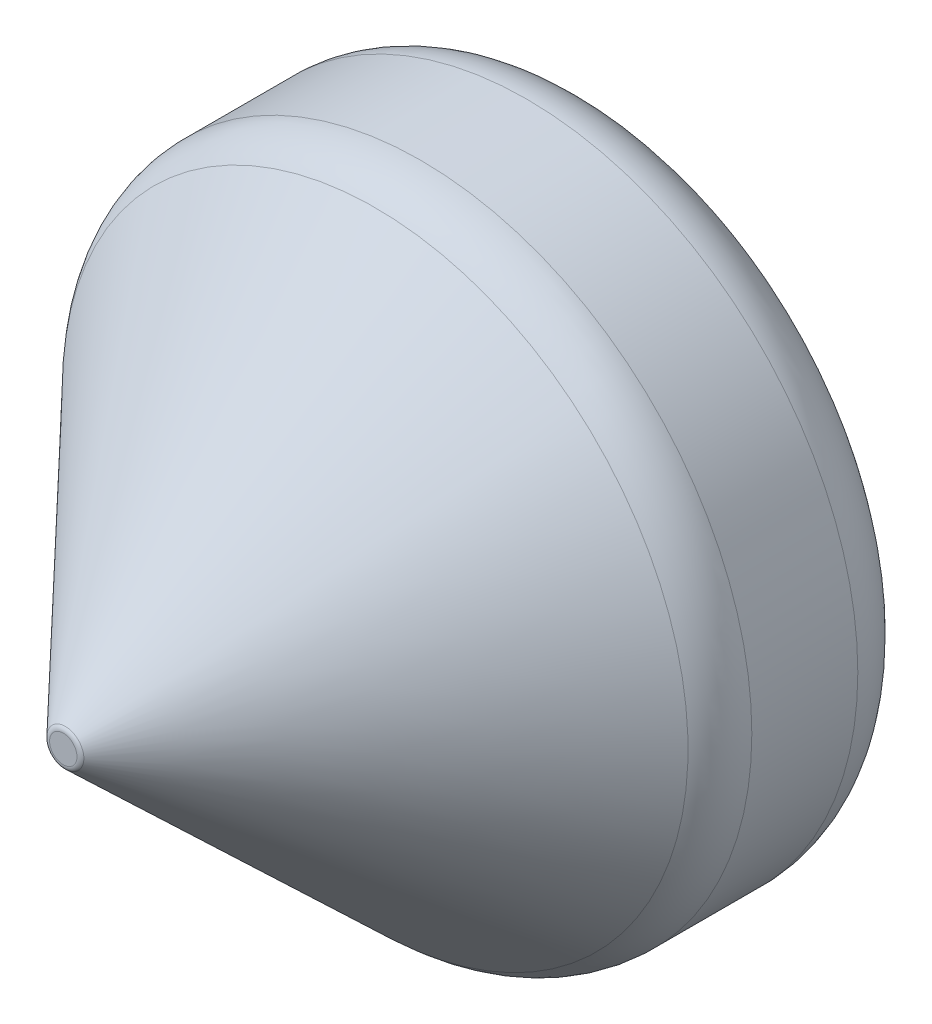
ISO-10303-21;
HEADER;
FILE_DESCRIPTION(('STEP AP214'),'2;1');
FILE_NAME('part.step','',(''),(''),'','','');
FILE_SCHEMA(('AUTOMOTIVE_DESIGN { 1 0 10303 214 1 1 1 1 }'));
ENDSEC;
DATA;
#1=APPLICATION_CONTEXT('core data for automotive mechanical design processes');
#2=APPLICATION_PROTOCOL_DEFINITION('international standard','automotive_design',2000,#1);
#3=PRODUCT_CONTEXT('',#1,'mechanical');
#4=PRODUCT('Part','Part','',(#3));
#5=PRODUCT_RELATED_PRODUCT_CATEGORY('part','',(#4));
#6=PRODUCT_DEFINITION_FORMATION('','',#4);
#7=PRODUCT_DEFINITION_CONTEXT('part definition',#1,'design');
#8=PRODUCT_DEFINITION('design','',#6,#7);
#9=PRODUCT_DEFINITION_SHAPE('','',#8);
#10=(LENGTH_UNIT() NAMED_UNIT(*) SI_UNIT(.MILLI.,.METRE.));
#11=(NAMED_UNIT(*) PLANE_ANGLE_UNIT() SI_UNIT($,.RADIAN.));
#12=(NAMED_UNIT(*) SI_UNIT($,.STERADIAN.) SOLID_ANGLE_UNIT());
#13=UNCERTAINTY_MEASURE_WITH_UNIT(LENGTH_MEASURE(1.E-05),#10,'distance_accuracy_value','');
#14=(GEOMETRIC_REPRESENTATION_CONTEXT(3) GLOBAL_UNCERTAINTY_ASSIGNED_CONTEXT((#13)) GLOBAL_UNIT_ASSIGNED_CONTEXT((#10,
#11,#12)) REPRESENTATION_CONTEXT('',''));
#15=CARTESIAN_POINT('',(0.,0.,0.));
#16=DIRECTION('',(0.,0.,1.));
#17=DIRECTION('',(1.,0.,0.));
#18=AXIS2_PLACEMENT_3D('',#15,#16,#17);
#19=CARTESIAN_POINT('',(0.,0.,-12.));
#20=DIRECTION('',(0.,0.,1.));
#21=DIRECTION('',(1.,0.,0.));
#22=AXIS2_PLACEMENT_3D('',#19,#20,#21);
#23=CYLINDRICAL_SURFACE('',#22,13.);
#24=CARTESIAN_POINT('',(-13.,0.,-5.94));
#25=CARTESIAN_POINT('',(-12.9999981798433,0.111634129459772,-5.94000457699668));
#26=CARTESIAN_POINT('',(-12.9985470068655,0.22333218292912,-5.94937819263295));
#27=CARTESIAN_POINT('',(-12.9928976712786,0.443603799648007,-5.98661414637654));
#28=CARTESIAN_POINT('',(-12.9886968669639,0.552174253226696,-6.01449426495225));
#29=CARTESIAN_POINT('',(-12.9780201450358,0.762971221767026,-6.08788844466843));
#30=CARTESIAN_POINT('',(-12.9715459788835,0.865202549429167,-6.13338893335273));
#31=CARTESIAN_POINT('',(-12.9570371396926,1.06056417054209,-6.24069855495145));
#32=CARTESIAN_POINT('',(-12.9490026748879,1.15369567594379,-6.30250551203664));
#33=CARTESIAN_POINT('',(-12.9321924031196,1.32899277202474,-6.44121345371));
#34=CARTESIAN_POINT('',(-12.923411590907,1.41107292146211,-6.51822182254765));
#35=CARTESIAN_POINT('',(-12.9061372591379,1.56119998237499,-6.68491550162835));
#36=CARTESIAN_POINT('',(-12.8976437564756,1.6292460698243,-6.77460155573559));
#37=CARTESIAN_POINT('',(-12.8818571696186,1.74970824234049,-6.96468172278587));
#38=CARTESIAN_POINT('',(-12.874570554198,1.80204125030049,-7.0651290692651));
#39=CARTESIAN_POINT('',(-12.8620913537326,1.88906073325816,-7.27351887906536));
#40=CARTESIAN_POINT('',(-12.8568986485617,1.92374822059572,-7.38146091200539));
#41=CARTESIAN_POINT('',(-12.8492445576298,1.97422579132361,-7.60087579095453));
#42=CARTESIAN_POINT('',(-12.8467620000393,1.99016243475775,-7.71231416788515));
#43=CARTESIAN_POINT('',(-12.8447450655813,2.00314004931484,-7.93630892990471));
#44=CARTESIAN_POINT('',(-12.8452105107546,2.00018216102485,-8.04886524709854));
#45=CARTESIAN_POINT('',(-12.8490176386625,1.97557435962365,-8.27086310366346));
#46=CARTESIAN_POINT('',(-12.852334155509,1.9540879888833,-8.38032326510987));
#47=CARTESIAN_POINT('',(-12.8614304087007,1.89328929394482,-8.59406608226442));
#48=CARTESIAN_POINT('',(-12.8672102180321,1.85397644155405,-8.69834858445868));
#49=CARTESIAN_POINT('',(-12.8806094791762,1.75847159016806,-8.89927169770105));
#50=CARTESIAN_POINT('',(-12.8882364224677,1.7022106216098,-8.99587900534495));
#51=CARTESIAN_POINT('',(-12.9044652207238,1.57445566474822,-9.17834374933545));
#52=CARTESIAN_POINT('',(-12.9130671429243,1.50296062558221,-9.26420044344408));
#53=CARTESIAN_POINT('',(-12.9303877351212,1.3458707741095,-9.42367437724266));
#54=CARTESIAN_POINT('',(-12.939106680676,1.2601354172487,-9.49715321407389));
#55=CARTESIAN_POINT('',(-12.9555948808269,1.07747683573123,-9.62870090383103));
#56=CARTESIAN_POINT('',(-12.9633641308639,0.980553557370509,-9.68676968278146));
#57=CARTESIAN_POINT('',(-12.977086290908,0.778148209221874,-9.78585722519085));
#58=CARTESIAN_POINT('',(-12.9830380261278,0.672660659263364,-9.82686496708427));
#59=CARTESIAN_POINT('',(-12.992444828946,0.456184081690752,-9.89054425674362));
#60=CARTESIAN_POINT('',(-12.9959000741847,0.345195446112753,-9.91321710916126));
#61=CARTESIAN_POINT('',(-12.999900977609,0.122061413656298,-9.93939818817922));
#62=CARTESIAN_POINT('',(-13.000475512886,0.0099388341483181,-9.94309662866594));
#63=CARTESIAN_POINT('',(-12.9987289757846,-0.213325058692731,-9.93172928039578));
#64=CARTESIAN_POINT('',(-12.9964079978465,-0.324466403910715,-9.91666410363391));
#65=CARTESIAN_POINT('',(-12.9891490837857,-0.542034248496511,-9.86835534939112));
#66=CARTESIAN_POINT('',(-12.9842245404646,-0.648481883728961,-9.83520477603376));
#67=CARTESIAN_POINT('',(-12.9723087739691,-0.854308287939675,-9.75176456563786));
#68=CARTESIAN_POINT('',(-12.9653174494133,-0.953686709856465,-9.70147408782045));
#69=CARTESIAN_POINT('',(-12.9499729976666,-1.14338785915144,-9.58473773321355));
#70=CARTESIAN_POINT('',(-12.94160989393,-1.23363576499287,-9.51817160424487));
#71=CARTESIAN_POINT('',(-12.9244828841827,-1.40174739518524,-9.37094049058091));
#72=CARTESIAN_POINT('',(-12.9157189536244,-1.47961035974428,-9.29027464153208));
#73=CARTESIAN_POINT('',(-12.8986860695372,-1.62143687177062,-9.11628566905067));
#74=CARTESIAN_POINT('',(-12.8904221246483,-1.68527268254131,-9.02285785594593));
#75=CARTESIAN_POINT('',(-12.8754146609527,-1.79634400375255,-8.82649362354842));
#76=CARTESIAN_POINT('',(-12.8686710994129,-1.84357998078108,-8.72355747161868));
#77=CARTESIAN_POINT('',(-12.8575044908204,-1.91991433220861,-8.51147416501527));
#78=CARTESIAN_POINT('',(-12.8530729567255,-1.94907911782486,-8.40235138015846));
#79=CARTESIAN_POINT('',(-12.8470098709954,-1.98865407244709,-8.18068298779681));
#80=CARTESIAN_POINT('',(-12.8453781150375,-1.99906561003298,-8.06813763067504));
#81=CARTESIAN_POINT('',(-12.8451072329882,-2.00080471457037,-7.84409252975454));
#82=CARTESIAN_POINT('',(-12.8464366045642,-1.99233317092469,-7.7325943316649));
#83=CARTESIAN_POINT('',(-12.8518695985565,-1.95697794807654,-7.5126287899459));
#84=CARTESIAN_POINT('',(-12.8559732155853,-1.93009430462956,-7.40416144043118));
#85=CARTESIAN_POINT('',(-12.8664810988442,-1.85875038208619,-7.19339715876237));
#86=CARTESIAN_POINT('',(-12.8728834317255,-1.81430487035791,-7.09109512542093));
#87=CARTESIAN_POINT('',(-12.8872696044034,-1.7091189717658,-6.89536733101889));
#88=CARTESIAN_POINT('',(-12.8952535033351,-1.64837797557981,-6.80194190204998));
#89=CARTESIAN_POINT('',(-12.9120041996598,-1.51159830040354,-6.62559990285593));
#90=CARTESIAN_POINT('',(-12.9207781015993,-1.43541104590757,-6.5427992360313));
#91=CARTESIAN_POINT('',(-12.9380614876198,-1.27021551598636,-6.39108723803731));
#92=CARTESIAN_POINT('',(-12.9465709098818,-1.18120427010544,-6.32217913373711));
#93=CARTESIAN_POINT('',(-12.9624232087798,-0.992277722296825,-6.19984878588817));
#94=CARTESIAN_POINT('',(-12.9697590240101,-0.892302099536091,-6.14651879660763));
#95=CARTESIAN_POINT('',(-12.9823684829832,-0.68474512681887,-6.05748853657165));
#96=CARTESIAN_POINT('',(-12.9876442432633,-0.577171717906742,-6.02177016135902));
#97=CARTESIAN_POINT('',(-12.9943465728122,-0.390941400069085,-5.97700286253061));
#98=CARTESIAN_POINT('',(-12.9964556222015,-0.313429175326517,-5.96314821853999));
#99=CARTESIAN_POINT('',(-12.9992829677305,-0.157288536394365,-5.94464523649309));
#100=CARTESIAN_POINT('',(-13.0000012825269,-0.0786601371924726,-5.93999677493623));
#101=CARTESIAN_POINT('',(-13.,0.,-5.94));
#102=B_SPLINE_CURVE_WITH_KNOTS('',3,(#24,#25,#26,#27,#28,#29,#30,#31,#32,#33,#34,#35,#36,#37,
#38,#39,#40,#41,#42,#43,#44,#45,#46,#47,#48,#49,#50,#51,#52,#53,#54,#55,#56,#57,#58,#59,#60,#61,
#62,#63,#64,#65,#66,#67,#68,#69,#70,#71,#72,#73,#74,#75,#76,#77,#78,#79,#80,#81,#82,#83,#84,#85,
#86,#87,#88,#89,#90,#91,#92,#93,#94,#95,#96,#97,#98,#99,#100,#101),.UNSPECIFIED.,.T.,.F.,(4,2,2,
2,2,2,2,2,2,2,2,2,2,2,2,2,2,2,2,2,2,2,2,2,2,2,2,2,2,2,2,2,2,2,2,2,2,2,4),(0.,0.334614935402754,
0.669551824578953,1.00423123317535,1.33886600689115,1.6759552066042,2.0130641932687,
2.35192534458353,2.69076705292645,3.02694233717946,3.36309732807122,3.69631525463015,
4.02954305496923,4.36414566185345,4.69877135746454,5.03692069824302,5.37507166226687,
5.71344073657471,6.05178573150937,6.38673217834278,6.72166770083347,7.05489683473247,
7.38814231716764,7.72392860544463,8.05973548561446,8.3984840953448,8.73722318277051,
9.07470991155933,9.41217201014685,9.74606114027121,10.0799496219992,10.4135579400877,
10.7471787342265,11.0841753844584,11.4212502200089,11.7602825362115,12.0989656022034,
12.3347466304,12.5705244955816),.UNSPECIFIED.);
#103=CARTESIAN_POINT('',(-13.,0.,-5.94));
#104=VERTEX_POINT('',#103);
#105=EDGE_CURVE('E201',#104,#104,#102,.T.);
#106=ORIENTED_EDGE('',*,*,#105,.F.);
#107=EDGE_LOOP('',(#106));
#108=FACE_BOUND('',#107,.T.);
#109=DIRECTION('',(0.,0.,1.));
#110=VECTOR('',#109,1.);
#111=CARTESIAN_POINT('',(-12.6491106406735,3.,-12.));
#112=LINE('',#111,#110);
#113=CARTESIAN_POINT('',(-12.6491106406735,3.,-12.));
#114=VERTEX_POINT('',#113);
#115=CARTESIAN_POINT('',(-12.6491106406735,3.,0.));
#116=VERTEX_POINT('',#115);
#117=EDGE_CURVE('E181',#114,#116,#112,.T.);
#118=ORIENTED_EDGE('',*,*,#117,.F.);
#119=CARTESIAN_POINT('',(0.,0.,-12.));
#120=DIRECTION('',(0.,0.,-1.));
#121=DIRECTION('',(-1.,0.,0.));
#122=AXIS2_PLACEMENT_3D('',#119,#120,#121);
#123=CIRCLE('',#122,13.);
#124=CARTESIAN_POINT('',(-12.6491106406735,-3.,-12.));
#125=VERTEX_POINT('',#124);
#126=EDGE_CURVE('E143',#125,#114,#123,.T.);
#127=ORIENTED_EDGE('',*,*,#126,.F.);
#128=DIRECTION('',(0.,0.,1.));
#129=VECTOR('',#128,1.);
#130=CARTESIAN_POINT('',(-12.6491106406735,-3.,-12.));
#131=LINE('',#130,#129);
#132=CARTESIAN_POINT('',(-12.6491106406735,-3.,0.));
#133=VERTEX_POINT('',#132);
#134=EDGE_CURVE('E65',#133,#125,#131,.F.);
#135=ORIENTED_EDGE('',*,*,#134,.F.);
#136=CARTESIAN_POINT('',(0.,0.,0.));
#137=DIRECTION('',(0.,0.,-1.));
#138=DIRECTION('',(-1.,0.,0.));
#139=AXIS2_PLACEMENT_3D('',#136,#137,#138);
#140=CIRCLE('',#139,13.);
#141=EDGE_CURVE('E156',#133,#116,#140,.T.);
#142=ORIENTED_EDGE('',*,*,#141,.T.);
#143=EDGE_LOOP('',(#118,#127,#135,#142));
#144=FACE_BOUND('',#143,.T.);
#145=ADVANCED_FACE('F49',(#108,#144),#23,.T.);
#146=CARTESIAN_POINT('',(13.,0.,-9.94));
#147=CARTESIAN_POINT('',(12.9999981798433,0.111634129459772,-9.93999542300332));
#148=CARTESIAN_POINT('',(12.9985470068655,0.22333218292912,-9.93062180736705));
#149=CARTESIAN_POINT('',(12.9928976712786,0.443603799648007,-9.89338585362346));
#150=CARTESIAN_POINT('',(12.9886968669639,0.552174253226695,-9.86550573504775));
#151=CARTESIAN_POINT('',(12.9780201450358,0.762971221767026,-9.79211155533157));
#152=CARTESIAN_POINT('',(12.9715459788835,0.865202549429167,-9.74661106664727));
#153=CARTESIAN_POINT('',(12.9570371396926,1.06056417054209,-9.63930144504855));
#154=CARTESIAN_POINT('',(12.9490026748879,1.15369567594379,-9.57749448796337));
#155=CARTESIAN_POINT('',(12.9321924031196,1.32899277202474,-9.43878654629));
#156=CARTESIAN_POINT('',(12.923411590907,1.41107292146211,-9.36177817745235));
#157=CARTESIAN_POINT('',(12.9061372591379,1.56119998237499,-9.19508449837165));
#158=CARTESIAN_POINT('',(12.8976437564756,1.6292460698243,-9.10539844426441));
#159=CARTESIAN_POINT('',(12.8818571696186,1.74970824234049,-8.91531827721414));
#160=CARTESIAN_POINT('',(12.874570554198,1.80204125030049,-8.81487093073491));
#161=CARTESIAN_POINT('',(12.8620913537326,1.88906073325816,-8.60648112093464));
#162=CARTESIAN_POINT('',(12.8568986485617,1.92374822059572,-8.49853908799461));
#163=CARTESIAN_POINT('',(12.8492445576298,1.97422579132361,-8.27912420904547));
#164=CARTESIAN_POINT('',(12.8467620000393,1.99016243475775,-8.16768583211485));
#165=CARTESIAN_POINT('',(12.8447450655813,2.00314004931484,-7.94369107009528));
#166=CARTESIAN_POINT('',(12.8452105107546,2.00018216102485,-7.83113475290146));
#167=CARTESIAN_POINT('',(12.8490176386625,1.97557435962365,-7.60913689633654));
#168=CARTESIAN_POINT('',(12.852334155509,1.9540879888833,-7.49967673489013));
#169=CARTESIAN_POINT('',(12.8614304087007,1.89328929394482,-7.28593391773558));
#170=CARTESIAN_POINT('',(12.8672102180321,1.85397644155405,-7.18165141554132));
#171=CARTESIAN_POINT('',(12.8806094791762,1.75847159016806,-6.98072830229895));
#172=CARTESIAN_POINT('',(12.8882364224677,1.7022106216098,-6.88412099465505));
#173=CARTESIAN_POINT('',(12.9044652207238,1.57445566474822,-6.70165625066455));
#174=CARTESIAN_POINT('',(12.9130671429243,1.50296062558221,-6.61579955655592));
#175=CARTESIAN_POINT('',(12.9303877351212,1.3458707741095,-6.45632562275734));
#176=CARTESIAN_POINT('',(12.939106680676,1.2601354172487,-6.38284678592611));
#177=CARTESIAN_POINT('',(12.9555948808269,1.07747683573123,-6.25129909616897));
#178=CARTESIAN_POINT('',(12.9633641308639,0.980553557370509,-6.19323031721854));
#179=CARTESIAN_POINT('',(12.977086290908,0.778148209221874,-6.09414277480916));
#180=CARTESIAN_POINT('',(12.9830380261278,0.672660659263363,-6.05313503291574));
#181=CARTESIAN_POINT('',(12.992444828946,0.456184081690752,-5.98945574325638));
#182=CARTESIAN_POINT('',(12.9959000741847,0.345195446112753,-5.96678289083874));
#183=CARTESIAN_POINT('',(12.999900977609,0.122061413656298,-5.94060181182078));
#184=CARTESIAN_POINT('',(13.000475512886,0.00993883414831777,-5.93690337133406));
#185=CARTESIAN_POINT('',(12.9987289757846,-0.213325058692732,-5.94827071960422));
#186=CARTESIAN_POINT('',(12.9964079978465,-0.324466403910715,-5.96333589636609));
#187=CARTESIAN_POINT('',(12.9891490837857,-0.542034248496511,-6.01164465060888));
#188=CARTESIAN_POINT('',(12.9842245404646,-0.648481883728961,-6.04479522396624));
#189=CARTESIAN_POINT('',(12.9723087739691,-0.854308287939675,-6.12823543436214));
#190=CARTESIAN_POINT('',(12.9653174494133,-0.953686709856466,-6.17852591217956));
#191=CARTESIAN_POINT('',(12.9499729976666,-1.14338785915144,-6.29526226678646));
#192=CARTESIAN_POINT('',(12.94160989393,-1.23363576499287,-6.36182839575513));
#193=CARTESIAN_POINT('',(12.9244828841827,-1.40174739518524,-6.50905950941909));
#194=CARTESIAN_POINT('',(12.9157189536244,-1.47961035974428,-6.58972535846792));
#195=CARTESIAN_POINT('',(12.8986860695372,-1.62143687177062,-6.76371433094934));
#196=CARTESIAN_POINT('',(12.8904221246483,-1.68527268254131,-6.85714214405408));
#197=CARTESIAN_POINT('',(12.8754146609527,-1.79634400375255,-7.05350637645158));
#198=CARTESIAN_POINT('',(12.8686710994129,-1.84357998078108,-7.15644252838132));
#199=CARTESIAN_POINT('',(12.8575044908204,-1.91991433220861,-7.36852583498473));
#200=CARTESIAN_POINT('',(12.8530729567255,-1.94907911782486,-7.47764861984154));
#201=CARTESIAN_POINT('',(12.8470098709954,-1.98865407244709,-7.69931701220319));
#202=CARTESIAN_POINT('',(12.8453781150375,-1.99906561003298,-7.81186236932497));
#203=CARTESIAN_POINT('',(12.8451072329882,-2.00080471457037,-8.03590747024546));
#204=CARTESIAN_POINT('',(12.8464366045642,-1.99233317092469,-8.1474056683351));
#205=CARTESIAN_POINT('',(12.8518695985565,-1.95697794807654,-8.36737121005411));
#206=CARTESIAN_POINT('',(12.8559732155853,-1.93009430462956,-8.47583855956883));
#207=CARTESIAN_POINT('',(12.8664810988442,-1.85875038208619,-8.68660284123763));
#208=CARTESIAN_POINT('',(12.8728834317255,-1.81430487035791,-8.78890487457907));
#209=CARTESIAN_POINT('',(12.8872696044034,-1.7091189717658,-8.98463266898112));
#210=CARTESIAN_POINT('',(12.8952535033351,-1.64837797557981,-9.07805809795002));
#211=CARTESIAN_POINT('',(12.9120041996598,-1.51159830040354,-9.25440009714407));
#212=CARTESIAN_POINT('',(12.9207781015993,-1.43541104590757,-9.33720076396871));
#213=CARTESIAN_POINT('',(12.9380614876198,-1.27021551598635,-9.48891276196269));
#214=CARTESIAN_POINT('',(12.9465709098818,-1.18120427010544,-9.55782086626289));
#215=CARTESIAN_POINT('',(12.9624232087798,-0.992277722296823,-9.68015121411183));
#216=CARTESIAN_POINT('',(12.9697590240101,-0.89230209953609,-9.73348120339238));
#217=CARTESIAN_POINT('',(12.9823684829832,-0.684745126818869,-9.82251146342835));
#218=CARTESIAN_POINT('',(12.9876442432633,-0.577171717906741,-9.85822983864098));
#219=CARTESIAN_POINT('',(12.9943465728122,-0.390941400069084,-9.90299713746939));
#220=CARTESIAN_POINT('',(12.9964556222015,-0.313429175326517,-9.91685178146002));
#221=CARTESIAN_POINT('',(12.9992829677305,-0.157288536394366,-9.93535476350691));
#222=CARTESIAN_POINT('',(13.0000012825269,-0.0786601371924729,-9.94000322506377));
#223=CARTESIAN_POINT('',(13.,0.,-9.94));
#224=B_SPLINE_CURVE_WITH_KNOTS('',3,(#146,#147,#148,#149,#150,#151,#152,#153,#154,#155,#156,
#157,#158,#159,#160,#161,#162,#163,#164,#165,#166,#167,#168,#169,#170,#171,#172,#173,#174,#175,
#176,#177,#178,#179,#180,#181,#182,#183,#184,#185,#186,#187,#188,#189,#190,#191,#192,#193,#194,
#195,#196,#197,#198,#199,#200,#201,#202,#203,#204,#205,#206,#207,#208,#209,#210,#211,#212,#213,
#214,#215,#216,#217,#218,#219,#220,#221,#222,#223),.UNSPECIFIED.,.T.,.F.,(4,2,2,2,2,2,2,2,2,2,2,
2,2,2,2,2,2,2,2,2,2,2,2,2,2,2,2,2,2,2,2,2,2,2,2,2,2,2,4),(0.,0.334614935402754,
0.669551824578953,1.00423123317535,1.33886600689116,1.6759552066042,2.0130641932687,
2.35192534458353,2.69076705292646,3.02694233717946,3.36309732807122,3.69631525463016,
4.02954305496923,4.36414566185345,4.69877135746454,5.03692069824302,5.37507166226687,
5.71344073657471,6.05178573150937,6.38673217834278,6.72166770083347,7.05489683473247,
7.38814231716764,7.72392860544463,8.05973548561446,8.39848409534481,8.73722318277052,
9.07470991155934,9.41217201014685,9.74606114027121,10.0799496219992,10.4135579400877,
10.7471787342265,11.0841753844584,11.4212502200089,11.7602825362115,12.0989656022034,
12.3347466304,12.5705244955816),.UNSPECIFIED.);
#225=CARTESIAN_POINT('',(13.,0.,-9.94));
#226=VERTEX_POINT('',#225);
#227=EDGE_CURVE('E209',#226,#226,#224,.T.);
#228=ORIENTED_EDGE('',*,*,#227,.F.);
#229=EDGE_LOOP('',(#228));
#230=FACE_BOUND('',#229,.T.);
#231=DIRECTION('',(0.,0.,1.));
#232=VECTOR('',#231,1.);
#233=CARTESIAN_POINT('',(12.6491106406735,3.,-12.));
#234=LINE('',#233,#232);
#235=CARTESIAN_POINT('',(12.6491106406735,3.,0.));
#236=VERTEX_POINT('',#235);
#237=CARTESIAN_POINT('',(12.6491106406735,3.,-12.));
#238=VERTEX_POINT('',#237);
#239=EDGE_CURVE('E73',#236,#238,#234,.F.);
#240=ORIENTED_EDGE('',*,*,#239,.F.);
#241=CARTESIAN_POINT('',(12.6491106406735,-3.,0.));
#242=VERTEX_POINT('',#241);
#243=EDGE_CURVE('E135',#236,#242,#140,.T.);
#244=ORIENTED_EDGE('',*,*,#243,.T.);
#245=DIRECTION('',(0.,0.,1.));
#246=VECTOR('',#245,1.);
#247=CARTESIAN_POINT('',(12.6491106406735,-3.,-12.));
#248=LINE('',#247,#246);
#249=CARTESIAN_POINT('',(12.6491106406735,-3.,-12.));
#250=VERTEX_POINT('',#249);
#251=EDGE_CURVE('E117',#250,#242,#248,.T.);
#252=ORIENTED_EDGE('',*,*,#251,.F.);
#253=EDGE_CURVE('E133',#238,#250,#123,.T.);
#254=ORIENTED_EDGE('',*,*,#253,.F.);
#255=EDGE_LOOP('',(#240,#244,#252,#254));
#256=FACE_BOUND('',#255,.T.);
#257=ADVANCED_FACE('F132',(#230,#256),#23,.T.);
#258=CARTESIAN_POINT('',(0.,0.,0.));
#259=DIRECTION('',(0.,0.,-1.));
#260=DIRECTION('',(-1.,0.,0.));
#261=AXIS2_PLACEMENT_3D('',#258,#259,#260);
#262=CYLINDRICAL_SURFACE('',#261,12.);
#263=CARTESIAN_POINT('',(12.,0.,-5.94));
#264=CARTESIAN_POINT('',(11.9999980893506,0.111512723966572,-5.94000447115825));
#265=CARTESIAN_POINT('',(11.9984294233043,0.223086305471057,-5.94935781997514));
#266=CARTESIAN_POINT('',(11.9923227595311,0.443104177338434,-5.98650852701226));
#267=CARTESIAN_POINT('',(11.9877820313911,0.551545494367397,-6.01432284552928));
#268=CARTESIAN_POINT('',(11.9762405458916,0.762083797770115,-6.0875323588742));
#269=CARTESIAN_POINT('',(11.9692418012735,0.86418589474552,-6.13291317251246));
#270=CARTESIAN_POINT('',(11.9535538166566,1.05931347358236,-6.23992983364192));
#271=CARTESIAN_POINT('',(11.9448647700355,1.15233999190287,-6.3015638219864));
#272=CARTESIAN_POINT('',(11.9266665396665,1.32757809143334,-6.43996406705637));
#273=CARTESIAN_POINT('',(11.9171509745189,1.40969032282797,-6.5168552917089));
#274=CARTESIAN_POINT('',(11.8984210150139,1.55991079892794,-6.68331837477825));
#275=CARTESIAN_POINT('',(11.8892066397013,1.62801815951278,-6.77289103316529));
#276=CARTESIAN_POINT('',(11.8720605260782,1.74869370048411,-6.96285677295765));
#277=CARTESIAN_POINT('',(11.8641370327331,1.8011636422888,-7.06331306944381));
#278=CARTESIAN_POINT('',(11.8505583183574,1.88844669232898,-7.2717676514405));
#279=CARTESIAN_POINT('',(11.8449029441145,1.92326099325249,-7.37976542694211));
#280=CARTESIAN_POINT('',(11.836564294742,1.97393150222785,-7.59918421988523));
#281=CARTESIAN_POINT('',(11.8338541478856,1.98995922330832,-7.71056458920111));
#282=CARTESIAN_POINT('',(11.8316315114932,2.0031333802319,-7.93446422150678));
#283=CARTESIAN_POINT('',(11.8321187956577,2.0002811523112,-8.04698340333384));
#284=CARTESIAN_POINT('',(11.8362114309084,1.97591607871692,-8.26874228902036));
#285=CARTESIAN_POINT('',(11.8397845865513,1.95459590551182,-8.37800384283619));
#286=CARTESIAN_POINT('',(11.8495959616881,1.89420251232276,-8.59137705426331));
#287=CARTESIAN_POINT('',(11.8558342725862,1.85512868345579,-8.69548853511084));
#288=CARTESIAN_POINT('',(11.8703078346728,1.76014179687513,-8.89618305875273));
#289=CARTESIAN_POINT('',(11.8785525368586,1.70414873110377,-8.99272752486498));
#290=CARTESIAN_POINT('',(11.8961033473201,1.57696961404595,-9.17512352043071));
#291=CARTESIAN_POINT('',(11.9054095412343,1.50578233652343,-9.26097418596395));
#292=CARTESIAN_POINT('',(11.9241762230383,1.34918576972724,-9.42066086864588));
#293=CARTESIAN_POINT('',(11.9336371938532,1.2636111710985,-9.49433481483207));
#294=CARTESIAN_POINT('',(11.9515408111738,1.08122819918532,-9.62630221013227));
#295=CARTESIAN_POINT('',(11.959983451118,0.984419753525137,-9.68459556014658));
#296=CARTESIAN_POINT('',(11.9749111431433,0.782164732933368,-9.78416178170903));
#297=CARTESIAN_POINT('',(11.9813945472596,0.676710980451729,-9.82542033546501));
#298=CARTESIAN_POINT('',(11.9916600241013,0.460238676482185,-9.88959537219678));
#299=CARTESIAN_POINT('',(11.9954423228038,0.349220591343575,-9.91251338957897));
#300=CARTESIAN_POINT('',(11.9998490387415,0.126167921041299,-9.93913708676891));
#301=CARTESIAN_POINT('',(12.0005100241023,0.0141605897208086,-9.94306525744449));
#302=CARTESIAN_POINT('',(11.9986997953694,-0.208911818311911,-9.9321909244575));
#303=CARTESIAN_POINT('',(11.9962287017929,-0.319976931113632,-9.91738914149301));
#304=CARTESIAN_POINT('',(11.9884546155056,-0.537324940437411,-9.86966012053162));
#305=CARTESIAN_POINT('',(11.9831688384105,-0.643632694708303,-9.8368430332879));
#306=CARTESIAN_POINT('',(11.9703557156429,-0.849237507888353,-9.75413238544037));
#307=CARTESIAN_POINT('',(11.9628282440962,-0.948534172727775,-9.70423786589178));
#308=CARTESIAN_POINT('',(11.9462761304193,-1.13826455157517,-9.58827910024257));
#309=CARTESIAN_POINT('',(11.9372388470962,-1.22861220074972,-9.5220758750662));
#310=CARTESIAN_POINT('',(11.9187077391352,-1.39699486840215,-9.37557014769195));
#311=CARTESIAN_POINT('',(11.9092138813724,-1.47502899175727,-9.29526662137866));
#312=CARTESIAN_POINT('',(11.8907214018868,-1.6173942237264,-9.12184196154286));
#313=CARTESIAN_POINT('',(11.8817289290968,-1.68157500889097,-9.02859666758847));
#314=CARTESIAN_POINT('',(11.8653722382231,-1.79336184823599,-8.83251762468917));
#315=CARTESIAN_POINT('',(11.8580079685282,-1.84096842781586,-8.729684179818));
#316=CARTESIAN_POINT('',(11.8457876295816,-1.91803066517852,-8.51776821375029));
#317=CARTESIAN_POINT('',(11.8409212344885,-1.94756114603836,-8.40871352397561));
#318=CARTESIAN_POINT('',(11.8342217346821,-1.98786836302262,-8.18710389662259));
#319=CARTESIAN_POINT('',(11.8323883662618,-1.99864672955693,-8.07454926421436));
#320=CARTESIAN_POINT('',(11.8319738646721,-2.00109829283788,-7.85063586723007));
#321=CARTESIAN_POINT('',(11.8333524520452,-1.99300810890015,-7.73927969713977));
#322=CARTESIAN_POINT('',(11.8391182516298,-1.95846387116548,-7.51953660155939));
#323=CARTESIAN_POINT('',(11.8435054540897,-1.93200987688998,-7.4111496664465));
#324=CARTESIAN_POINT('',(11.8547788502538,-1.86157959167592,-7.20051325016591));
#325=CARTESIAN_POINT('',(11.8616621377574,-1.81762367248035,-7.09825679195518));
#326=CARTESIAN_POINT('',(11.8771549513777,-1.71346160313273,-6.90253146464412));
#327=CARTESIAN_POINT('',(11.8857645631072,-1.65325464699885,-6.80906303170229));
#328=CARTESIAN_POINT('',(11.903867632365,-1.51745510749772,-6.6323715335138));
#329=CARTESIAN_POINT('',(11.9133703646104,-1.44168845087492,-6.54928318663978));
#330=CARTESIAN_POINT('',(11.9321149788867,-1.27728722510418,-6.39691871642005));
#331=CARTESIAN_POINT('',(11.9413568002124,-1.18864969033011,-6.32764578508946));
#332=CARTESIAN_POINT('',(11.9586122371378,-1.00029533571222,-6.20444138544005));
#333=CARTESIAN_POINT('',(11.9666169300248,-0.900506230026254,-6.15061916854964));
#334=CARTESIAN_POINT('',(11.9804093408142,-0.693210455503184,-6.06058441231206));
#335=CARTESIAN_POINT('',(11.9861992654199,-0.585711595864007,-6.02435433513624));
#336=CARTESIAN_POINT('',(11.9936463266636,-0.39816264803632,-5.97839578069867));
#337=CARTESIAN_POINT('',(11.9960162181869,-0.319247064238757,-5.96402042430723));
#338=CARTESIAN_POINT('',(11.999193727889,-0.160231448255847,-5.9448210097242));
#339=CARTESIAN_POINT('',(12.0000013729651,-0.0801314364867952,-5.93999678709011));
#340=CARTESIAN_POINT('',(12.,0.,-5.94));
#341=B_SPLINE_CURVE_WITH_KNOTS('',3,(#263,#264,#265,#266,#267,#268,#269,#270,#271,#272,#273,
#274,#275,#276,#277,#278,#279,#280,#281,#282,#283,#284,#285,#286,#287,#288,#289,#290,#291,#292,
#293,#294,#295,#296,#297,#298,#299,#300,#301,#302,#303,#304,#305,#306,#307,#308,#309,#310,#311,
#312,#313,#314,#315,#316,#317,#318,#319,#320,#321,#322,#323,#324,#325,#326,#327,#328,#329,#330,
#331,#332,#333,#334,#335,#336,#337,#338,#339,#340),.UNSPECIFIED.,.T.,.F.,(4,2,2,2,2,2,2,2,2,2,2,
2,2,2,2,2,2,2,2,2,2,2,2,2,2,2,2,2,2,2,2,2,2,2,2,2,2,2,4),(0.,0.334245267950808,
0.668798036556336,1.00307749362021,1.33731873013983,1.67441992849866,2.01154240135885,
2.35074016659072,2.68991501500945,3.02596861682739,3.36199843456709,3.69456417408327,
4.02714132020305,4.36131645306046,4.69551856544459,5.03386215929061,5.37220793308678,
5.71083751132723,6.04943875616919,6.38406306793118,6.71867450428688,7.05126245605132,
7.38386908660853,7.71941460501619,8.05498450443426,8.39403057606095,8.73306589900754,
9.07068817873418,9.40828110229294,9.7416632761816,10.0750443695051,10.4080385458098,
10.7410492402347,11.0780110735471,11.4150506710318,11.7544178528576,12.0934460170406,
12.3336339853121,12.5738178182157),.UNSPECIFIED.);
#342=CARTESIAN_POINT('',(12.,0.,-5.94));
#343=VERTEX_POINT('',#342);
#344=EDGE_CURVE('E171',#343,#343,#341,.T.);
#345=ORIENTED_EDGE('',*,*,#344,.F.);
#346=EDGE_LOOP('',(#345));
#347=FACE_BOUND('',#346,.T.);
#348=DIRECTION('',(0.,0.,-1.));
#349=VECTOR('',#348,1.);
#350=CARTESIAN_POINT('',(11.6189500386223,3.,0.));
#351=LINE('',#350,#349);
#352=CARTESIAN_POINT('',(11.6189500386223,3.,-12.));
#353=VERTEX_POINT('',#352);
#354=CARTESIAN_POINT('',(11.6189500386223,3.,0.));
#355=VERTEX_POINT('',#354);
#356=EDGE_CURVE('E461',#353,#355,#351,.F.);
#357=ORIENTED_EDGE('',*,*,#356,.F.);
#358=CARTESIAN_POINT('',(0.,0.,-12.));
#359=DIRECTION('',(0.,0.,-1.));
#360=DIRECTION('',(-1.,0.,0.));
#361=AXIS2_PLACEMENT_3D('',#358,#359,#360);
#362=CIRCLE('',#361,12.);
#363=CARTESIAN_POINT('',(11.6189500386223,-3.,-12.));
#364=VERTEX_POINT('',#363);
#365=EDGE_CURVE('E439',#353,#364,#362,.T.);
#366=ORIENTED_EDGE('',*,*,#365,.T.);
#367=DIRECTION('',(0.,0.,-1.));
#368=VECTOR('',#367,1.);
#369=CARTESIAN_POINT('',(11.6189500386223,-3.,0.));
#370=LINE('',#369,#368);
#371=CARTESIAN_POINT('',(11.6189500386223,-3.,0.));
#372=VERTEX_POINT('',#371);
#373=EDGE_CURVE('E120',#372,#364,#370,.T.);
#374=ORIENTED_EDGE('',*,*,#373,.F.);
#375=CARTESIAN_POINT('',(0.,0.,0.));
#376=DIRECTION('',(0.,0.,-1.));
#377=DIRECTION('',(-1.,0.,0.));
#378=AXIS2_PLACEMENT_3D('',#375,#376,#377);
#379=CIRCLE('',#378,12.);
#380=EDGE_CURVE('E151',#355,#372,#379,.T.);
#381=ORIENTED_EDGE('',*,*,#380,.F.);
#382=EDGE_LOOP('',(#357,#366,#374,#381));
#383=FACE_BOUND('',#382,.T.);
#384=ADVANCED_FACE('F185',(#347,#383),#262,.F.);
#385=CARTESIAN_POINT('',(-12.,0.,-5.94));
#386=CARTESIAN_POINT('',(-11.9999980893506,-0.111512723966572,-5.94000447115825));
#387=CARTESIAN_POINT('',(-11.9984294233043,-0.223086305471057,-5.94935781997514));
#388=CARTESIAN_POINT('',(-11.9923227595311,-0.443104177338434,-5.98650852701226));
#389=CARTESIAN_POINT('',(-11.9877820313911,-0.551545494367397,-6.01432284552928));
#390=CARTESIAN_POINT('',(-11.9762405458916,-0.762083797770115,-6.0875323588742));
#391=CARTESIAN_POINT('',(-11.9692418012735,-0.86418589474552,-6.13291317251246));
#392=CARTESIAN_POINT('',(-11.9535538166566,-1.05931347358236,-6.23992983364192));
#393=CARTESIAN_POINT('',(-11.9448647700355,-1.15233999190287,-6.3015638219864));
#394=CARTESIAN_POINT('',(-11.9266665396665,-1.32757809143334,-6.43996406705637));
#395=CARTESIAN_POINT('',(-11.9171509745189,-1.40969032282797,-6.5168552917089));
#396=CARTESIAN_POINT('',(-11.8984210150139,-1.55991079892794,-6.68331837477825));
#397=CARTESIAN_POINT('',(-11.8892066397013,-1.62801815951278,-6.77289103316529));
#398=CARTESIAN_POINT('',(-11.8720605260782,-1.74869370048411,-6.96285677295765));
#399=CARTESIAN_POINT('',(-11.8641370327331,-1.8011636422888,-7.06331306944381));
#400=CARTESIAN_POINT('',(-11.8505583183574,-1.88844669232898,-7.2717676514405));
#401=CARTESIAN_POINT('',(-11.8449029441145,-1.92326099325249,-7.37976542694211));
#402=CARTESIAN_POINT('',(-11.836564294742,-1.97393150222785,-7.59918421988523));
#403=CARTESIAN_POINT('',(-11.8338541478856,-1.98995922330832,-7.71056458920111));
#404=CARTESIAN_POINT('',(-11.8316315114932,-2.0031333802319,-7.93446422150678));
#405=CARTESIAN_POINT('',(-11.8321187956577,-2.0002811523112,-8.04698340333384));
#406=CARTESIAN_POINT('',(-11.8362114309084,-1.97591607871692,-8.26874228902036));
#407=CARTESIAN_POINT('',(-11.8397845865513,-1.95459590551182,-8.37800384283619));
#408=CARTESIAN_POINT('',(-11.8495959616881,-1.89420251232276,-8.59137705426331));
#409=CARTESIAN_POINT('',(-11.8558342725862,-1.85512868345579,-8.69548853511084));
#410=CARTESIAN_POINT('',(-11.8703078346728,-1.76014179687513,-8.89618305875273));
#411=CARTESIAN_POINT('',(-11.8785525368586,-1.70414873110377,-8.99272752486498));
#412=CARTESIAN_POINT('',(-11.8961033473201,-1.57696961404595,-9.17512352043071));
#413=CARTESIAN_POINT('',(-11.9054095412343,-1.50578233652343,-9.26097418596395));
#414=CARTESIAN_POINT('',(-11.9241762230383,-1.34918576972724,-9.42066086864588));
#415=CARTESIAN_POINT('',(-11.9336371938532,-1.2636111710985,-9.49433481483207));
#416=CARTESIAN_POINT('',(-11.9515408111738,-1.08122819918532,-9.62630221013227));
#417=CARTESIAN_POINT('',(-11.959983451118,-0.984419753525137,-9.68459556014658));
#418=CARTESIAN_POINT('',(-11.9749111431433,-0.782164732933368,-9.78416178170903));
#419=CARTESIAN_POINT('',(-11.9813945472596,-0.676710980451729,-9.82542033546501));
#420=CARTESIAN_POINT('',(-11.9916600241013,-0.460238676482185,-9.88959537219678));
#421=CARTESIAN_POINT('',(-11.9954423228038,-0.349220591343575,-9.91251338957897));
#422=CARTESIAN_POINT('',(-11.9998490387415,-0.126167921041299,-9.93913708676891));
#423=CARTESIAN_POINT('',(-12.0005100241023,-0.0141605897208086,-9.94306525744449));
#424=CARTESIAN_POINT('',(-11.9986997953694,0.208911818311911,-9.9321909244575));
#425=CARTESIAN_POINT('',(-11.9962287017929,0.319976931113632,-9.91738914149301));
#426=CARTESIAN_POINT('',(-11.9884546155056,0.537324940437411,-9.86966012053162));
#427=CARTESIAN_POINT('',(-11.9831688384105,0.643632694708303,-9.8368430332879));
#428=CARTESIAN_POINT('',(-11.9703557156429,0.849237507888353,-9.75413238544037));
#429=CARTESIAN_POINT('',(-11.9628282440962,0.948534172727775,-9.70423786589178));
#430=CARTESIAN_POINT('',(-11.9462761304193,1.13826455157517,-9.58827910024257));
#431=CARTESIAN_POINT('',(-11.9372388470962,1.22861220074972,-9.5220758750662));
#432=CARTESIAN_POINT('',(-11.9187077391352,1.39699486840215,-9.37557014769195));
#433=CARTESIAN_POINT('',(-11.9092138813724,1.47502899175727,-9.29526662137866));
#434=CARTESIAN_POINT('',(-11.8907214018868,1.6173942237264,-9.12184196154286));
#435=CARTESIAN_POINT('',(-11.8817289290968,1.68157500889097,-9.02859666758847));
#436=CARTESIAN_POINT('',(-11.8653722382231,1.79336184823599,-8.83251762468917));
#437=CARTESIAN_POINT('',(-11.8580079685282,1.84096842781586,-8.729684179818));
#438=CARTESIAN_POINT('',(-11.8457876295816,1.91803066517852,-8.51776821375029));
#439=CARTESIAN_POINT('',(-11.8409212344885,1.94756114603836,-8.40871352397561));
#440=CARTESIAN_POINT('',(-11.8342217346821,1.98786836302262,-8.18710389662259));
#441=CARTESIAN_POINT('',(-11.8323883662618,1.99864672955693,-8.07454926421436));
#442=CARTESIAN_POINT('',(-11.8319738646721,2.00109829283788,-7.85063586723007));
#443=CARTESIAN_POINT('',(-11.8333524520452,1.99300810890015,-7.73927969713977));
#444=CARTESIAN_POINT('',(-11.8391182516298,1.95846387116548,-7.51953660155939));
#445=CARTESIAN_POINT('',(-11.8435054540897,1.93200987688998,-7.4111496664465));
#446=CARTESIAN_POINT('',(-11.8547788502538,1.86157959167592,-7.20051325016591));
#447=CARTESIAN_POINT('',(-11.8616621377574,1.81762367248035,-7.09825679195518));
#448=CARTESIAN_POINT('',(-11.8771549513777,1.71346160313273,-6.90253146464412));
#449=CARTESIAN_POINT('',(-11.8857645631072,1.65325464699885,-6.80906303170229));
#450=CARTESIAN_POINT('',(-11.903867632365,1.51745510749772,-6.6323715335138));
#451=CARTESIAN_POINT('',(-11.9133703646104,1.44168845087492,-6.54928318663978));
#452=CARTESIAN_POINT('',(-11.9321149788867,1.27728722510418,-6.39691871642005));
#453=CARTESIAN_POINT('',(-11.9413568002124,1.18864969033011,-6.32764578508946));
#454=CARTESIAN_POINT('',(-11.9586122371378,1.00029533571222,-6.20444138544005));
#455=CARTESIAN_POINT('',(-11.9666169300248,0.900506230026254,-6.15061916854964));
#456=CARTESIAN_POINT('',(-11.9804093408142,0.693210455503184,-6.06058441231206));
#457=CARTESIAN_POINT('',(-11.9861992654199,0.585711595864007,-6.02435433513624));
#458=CARTESIAN_POINT('',(-11.9936463266636,0.39816264803632,-5.97839578069867));
#459=CARTESIAN_POINT('',(-11.9960162181869,0.319247064238757,-5.96402042430723));
#460=CARTESIAN_POINT('',(-11.999193727889,0.160231448255847,-5.9448210097242));
#461=CARTESIAN_POINT('',(-12.0000013729651,0.0801314364867952,-5.93999678709011));
#462=CARTESIAN_POINT('',(-12.,0.,-5.94));
#463=B_SPLINE_CURVE_WITH_KNOTS('',3,(#385,#386,#387,#388,#389,#390,#391,#392,#393,#394,#395,
#396,#397,#398,#399,#400,#401,#402,#403,#404,#405,#406,#407,#408,#409,#410,#411,#412,#413,#414,
#415,#416,#417,#418,#419,#420,#421,#422,#423,#424,#425,#426,#427,#428,#429,#430,#431,#432,#433,
#434,#435,#436,#437,#438,#439,#440,#441,#442,#443,#444,#445,#446,#447,#448,#449,#450,#451,#452,
#453,#454,#455,#456,#457,#458,#459,#460,#461,#462),.UNSPECIFIED.,.T.,.F.,(4,2,2,2,2,2,2,2,2,2,2,
2,2,2,2,2,2,2,2,2,2,2,2,2,2,2,2,2,2,2,2,2,2,2,2,2,2,2,4),(0.,0.334245267950808,
0.668798036556336,1.00307749362021,1.33731873013983,1.67441992849866,2.01154240135885,
2.35074016659072,2.68991501500945,3.02596861682739,3.36199843456709,3.69456417408327,
4.02714132020305,4.36131645306046,4.69551856544459,5.03386215929061,5.37220793308678,
5.71083751132723,6.04943875616919,6.38406306793118,6.71867450428688,7.05126245605132,
7.38386908660853,7.71941460501619,8.05498450443426,8.39403057606095,8.73306589900754,
9.07068817873418,9.40828110229294,9.7416632761816,10.0750443695051,10.4080385458098,
10.7410492402347,11.0780110735471,11.4150506710318,11.7544178528576,12.0934460170406,
12.3336339853121,12.5738178182157),.UNSPECIFIED.);
#464=CARTESIAN_POINT('',(-12.,0.,-5.94));
#465=VERTEX_POINT('',#464);
#466=EDGE_CURVE('E180',#465,#465,#463,.T.);
#467=ORIENTED_EDGE('',*,*,#466,.F.);
#468=EDGE_LOOP('',(#467));
#469=FACE_BOUND('',#468,.T.);
#470=DIRECTION('',(0.,0.,-1.));
#471=VECTOR('',#470,1.);
#472=CARTESIAN_POINT('',(-11.6189500386223,3.,0.));
#473=LINE('',#472,#471);
#474=CARTESIAN_POINT('',(-11.6189500386223,3.,0.));
#475=VERTEX_POINT('',#474);
#476=CARTESIAN_POINT('',(-11.6189500386223,3.,-12.));
#477=VERTEX_POINT('',#476);
#478=EDGE_CURVE('E137',#475,#477,#473,.T.);
#479=ORIENTED_EDGE('',*,*,#478,.F.);
#480=CARTESIAN_POINT('',(-11.6189500386223,-3.,0.));
#481=VERTEX_POINT('',#480);
#482=EDGE_CURVE('E445',#481,#475,#379,.T.);
#483=ORIENTED_EDGE('',*,*,#482,.F.);
#484=DIRECTION('',(0.,0.,-1.));
#485=VECTOR('',#484,1.);
#486=CARTESIAN_POINT('',(-11.6189500386223,-3.,0.));
#487=LINE('',#486,#485);
#488=CARTESIAN_POINT('',(-11.6189500386223,-3.,-12.));
#489=VERTEX_POINT('',#488);
#490=EDGE_CURVE('E463',#489,#481,#487,.F.);
#491=ORIENTED_EDGE('',*,*,#490,.F.);
#492=EDGE_CURVE('E154',#489,#477,#362,.T.);
#493=ORIENTED_EDGE('',*,*,#492,.T.);
#494=EDGE_LOOP('',(#479,#483,#491,#493));
#495=FACE_BOUND('',#494,.T.);
#496=ADVANCED_FACE('F322',(#469,#495),#262,.F.);
#497=CARTESIAN_POINT('',(0.,0.,-12.));
#498=DIRECTION('',(0.,0.,-1.));
#499=DIRECTION('',(-1.,0.,0.));
#500=AXIS2_PLACEMENT_3D('',#497,#498,#499);
#501=PLANE('',#500);
#502=ORIENTED_EDGE('',*,*,#126,.T.);
#503=DIRECTION('',(-1.,0.,0.));
#504=VECTOR('',#503,1.);
#505=CARTESIAN_POINT('',(17.,3.,-12.));
#506=LINE('',#505,#504);
#507=EDGE_CURVE('E481',#477,#114,#506,.T.);
#508=ORIENTED_EDGE('',*,*,#507,.F.);
#509=ORIENTED_EDGE('',*,*,#492,.F.);
#510=DIRECTION('',(-1.,0.,0.));
#511=VECTOR('',#510,1.);
#512=CARTESIAN_POINT('',(17.,-3.,-12.));
#513=LINE('',#512,#511);
#514=EDGE_CURVE('E127',#489,#125,#513,.T.);
#515=ORIENTED_EDGE('',*,*,#514,.T.);
#516=EDGE_LOOP('',(#502,#508,#509,#515));
#517=FACE_BOUND('',#516,.T.);
#518=ADVANCED_FACE('F218',(#517),#501,.T.);
#519=ORIENTED_EDGE('',*,*,#365,.F.);
#520=EDGE_CURVE('E140',#238,#353,#506,.T.);
#521=ORIENTED_EDGE('',*,*,#520,.F.);
#522=ORIENTED_EDGE('',*,*,#253,.T.);
#523=EDGE_CURVE('E114',#250,#364,#513,.T.);
#524=ORIENTED_EDGE('',*,*,#523,.T.);
#525=EDGE_LOOP('',(#519,#521,#522,#524));
#526=FACE_BOUND('',#525,.T.);
#527=ADVANCED_FACE('F139',(#526),#501,.T.);
#528=CARTESIAN_POINT('',(0.,0.,30.));
#529=DIRECTION('',(0.,0.,-1.));
#530=DIRECTION('',(-1.,0.,0.));
#531=AXIS2_PLACEMENT_3D('',#528,#529,#530);
#532=CYLINDRICAL_SURFACE('',#531,50.);
#533=CARTESIAN_POINT('',(0.,0.,10.));
#534=DIRECTION('',(0.,0.,1.));
#535=DIRECTION('',(1.,0.,0.));
#536=AXIS2_PLACEMENT_3D('',#533,#534,#535);
#537=CIRCLE('',#536,50.);
#538=CARTESIAN_POINT('',(50.,0.,10.));
#539=VERTEX_POINT('',#538);
#540=EDGE_CURVE('E58',#539,#539,#537,.T.);
#541=ORIENTED_EDGE('',*,*,#540,.T.);
#542=EDGE_LOOP('',(#541));
#543=FACE_BOUND('',#542,.T.);
#544=CARTESIAN_POINT('',(0.,0.,26.0072481851224));
#545=DIRECTION('',(0.,0.,-1.));
#546=DIRECTION('',(-1.,0.,0.));
#547=AXIS2_PLACEMENT_3D('',#544,#545,#546);
#548=CIRCLE('',#547,50.);
#549=CARTESIAN_POINT('',(-50.,0.,26.0072481851224));
#550=VERTEX_POINT('',#549);
#551=EDGE_CURVE('E148',#550,#550,#548,.T.);
#552=ORIENTED_EDGE('',*,*,#551,.T.);
#553=EDGE_LOOP('',(#552));
#554=FACE_BOUND('',#553,.T.);
#555=ADVANCED_FACE('F232',(#543,#554),#532,.T.);
#556=CARTESIAN_POINT('',(0.,0.,0.));
#557=DIRECTION('',(0.,0.,1.));
#558=DIRECTION('',(1.,0.,0.));
#559=AXIS2_PLACEMENT_3D('',#556,#557,#558);
#560=PLANE('',#559);
#561=CARTESIAN_POINT('',(0.,0.,0.));
#562=DIRECTION('',(0.,0.,1.));
#563=DIRECTION('',(1.,0.,0.));
#564=AXIS2_PLACEMENT_3D('',#561,#562,#563);
#565=CIRCLE('',#564,40.);
#566=CARTESIAN_POINT('',(40.,0.,0.));
#567=VERTEX_POINT('',#566);
#568=EDGE_CURVE('E12',#567,#567,#565,.F.);
#569=ORIENTED_EDGE('',*,*,#568,.T.);
#570=EDGE_LOOP('',(#569));
#571=FACE_BOUND('',#570,.T.);
#572=ORIENTED_EDGE('',*,*,#243,.F.);
#573=DIRECTION('',(-1.,0.,0.));
#574=VECTOR('',#573,1.);
#575=CARTESIAN_POINT('',(17.,3.,0.));
#576=LINE('',#575,#574);
#577=EDGE_CURVE('E460',#236,#355,#576,.T.);
#578=ORIENTED_EDGE('',*,*,#577,.T.);
#579=ORIENTED_EDGE('',*,*,#380,.T.);
#580=DIRECTION('',(-1.,0.,0.));
#581=VECTOR('',#580,1.);
#582=CARTESIAN_POINT('',(17.,-3.,0.));
#583=LINE('',#582,#581);
#584=EDGE_CURVE('E459',#242,#372,#583,.T.);
#585=ORIENTED_EDGE('',*,*,#584,.F.);
#586=EDGE_LOOP('',(#572,#578,#579,#585));
#587=FACE_BOUND('',#586,.T.);
#588=EDGE_CURVE('E468',#475,#116,#576,.T.);
#589=ORIENTED_EDGE('',*,*,#588,.T.);
#590=ORIENTED_EDGE('',*,*,#141,.F.);
#591=EDGE_CURVE('E126',#481,#133,#583,.T.);
#592=ORIENTED_EDGE('',*,*,#591,.F.);
#593=ORIENTED_EDGE('',*,*,#482,.T.);
#594=EDGE_LOOP('',(#589,#590,#592,#593));
#595=FACE_BOUND('',#594,.T.);
#596=ADVANCED_FACE('F224',(#571,#587,#595),#560,.F.);
#597=CARTESIAN_POINT('',(0.,0.,80.));
#598=DIRECTION('',(0.,0.,1.));
#599=DIRECTION('',(1.,0.,0.));
#600=AXIS2_PLACEMENT_3D('',#597,#598,#599);
#601=PLANE('',#600);
#602=CARTESIAN_POINT('',(0.,0.,80.));
#603=DIRECTION('',(0.,0.,1.));
#604=DIRECTION('',(1.,0.,0.));
#605=AXIS2_PLACEMENT_3D('',#602,#603,#604);
#606=CIRCLE('',#605,2.07068857758663);
#607=CARTESIAN_POINT('',(2.07068857758663,0.,80.));
#608=VERTEX_POINT('',#607);
#609=EDGE_CURVE('E164',#608,#608,#606,.T.);
#610=ORIENTED_EDGE('',*,*,#609,.T.);
#611=EDGE_LOOP('',(#610));
#612=FACE_BOUND('',#611,.T.);
#613=ADVANCED_FACE('F219',(#612),#601,.T.);
#614=CARTESIAN_POINT('',(0.,0.,80.));
#615=DIRECTION('',(0.,0.,-1.));
#616=DIRECTION('',(-1.,0.,0.));
#617=AXIS2_PLACEMENT_3D('',#614,#615,#616);
#618=CONICAL_SURFACE('',#617,2.5,0.759762754875771);
#619=CARTESIAN_POINT('',(0.,0.,79.6887494619147));
#620=DIRECTION('',(0.,0.,1.));
#621=DIRECTION('',(1.,0.,0.));
#622=AXIS2_PLACEMENT_3D('',#619,#620,#621);
#623=CIRCLE('',#622,2.79568801118104);
#624=CARTESIAN_POINT('',(-2.79568801118105,0.,79.6887494619147));
#625=VERTEX_POINT('',#624);
#626=EDGE_CURVE('E159',#625,#625,#623,.F.);
#627=CARTESIAN_POINT('',(0.,0.,32.8947428042693));
#628=DIRECTION('',(0.,0.,-1.));
#629=DIRECTION('',(-1.,0.,0.));
#630=AXIS2_PLACEMENT_3D('',#627,#628,#629);
#631=CIRCLE('',#630,47.2499943359441);
#632=CARTESIAN_POINT('',(-47.2499943359441,0.,32.8947428042693));
#633=VERTEX_POINT('',#632);
#634=EDGE_CURVE('E142',#633,#633,#631,.F.);
#635=CARTESIAN_POINT('',(-2.79568801118105,0.,79.6887494619147));
#636=CARTESIAN_POINT('',(-3.258753702064,0.,79.2013118925642));
#637=CARTESIAN_POINT('',(-3.72181939294695,0.,78.7138743232137));
#638=CARTESIAN_POINT('',(-4.64795077471285,0.,77.7389991845128));
#639=CARTESIAN_POINT('',(-5.1110164655958,0.,77.2515616151623));
#640=CARTESIAN_POINT('',(-6.03714784736169,0.,76.2766864764614));
#641=CARTESIAN_POINT('',(-6.50021353824464,0.,75.7892489071109));
#642=CARTESIAN_POINT('',(-7.42634492001054,0.,74.81437376841));
#643=CARTESIAN_POINT('',(-7.88941061089349,0.,74.3269361990595));
#644=CARTESIAN_POINT('',(-8.81554199265939,0.,73.3520610603585));
#645=CARTESIAN_POINT('',(-9.27860768354233,0.,72.8646234910081));
#646=CARTESIAN_POINT('',(-10.2047390653082,0.,71.8897483523071));
#647=CARTESIAN_POINT('',(-10.6678047561912,0.,71.4023107829567));
#648=CARTESIAN_POINT('',(-11.5939361379571,0.,70.4274356442557));
#649=CARTESIAN_POINT('',(-12.05700182884,0.,69.9399980749052));
#650=CARTESIAN_POINT('',(-12.9831332106059,0.,68.9651229362043));
#651=CARTESIAN_POINT('',(-13.4461989014889,0.,68.4776853668538));
#652=CARTESIAN_POINT('',(-14.3723302832548,0.,67.5028102281529));
#653=CARTESIAN_POINT('',(-14.8353959741377,0.,67.0153726588024));
#654=CARTESIAN_POINT('',(-15.7615273559036,0.,66.0404975201015));
#655=CARTESIAN_POINT('',(-16.2245930467866,0.,65.553059950751));
#656=CARTESIAN_POINT('',(-17.1507244285525,0.,64.57818481205));
#657=CARTESIAN_POINT('',(-17.6137901194354,0.,64.0907472426996));
#658=CARTESIAN_POINT('',(-18.5399215012013,0.,63.1158721039986));
#659=CARTESIAN_POINT('',(-19.0029871920843,0.,62.6284345346482));
#660=CARTESIAN_POINT('',(-19.9291185738502,0.,61.6535593959472));
#661=CARTESIAN_POINT('',(-20.3921842647331,0.,61.1661218265967));
#662=CARTESIAN_POINT('',(-21.318315646499,0.,60.1912466878958));
#663=CARTESIAN_POINT('',(-21.7813813373819,0.,59.7038091185453));
#664=CARTESIAN_POINT('',(-22.7075127191478,0.,58.7289339798444));
#665=CARTESIAN_POINT('',(-23.1705784100308,0.,58.2414964104939));
#666=CARTESIAN_POINT('',(-24.0967097917967,0.,57.266621271793));
#667=CARTESIAN_POINT('',(-24.5597754826796,0.,56.7791837024425));
#668=CARTESIAN_POINT('',(-25.4859068644455,0.,55.8043085637415));
#669=CARTESIAN_POINT('',(-25.9489725553285,0.,55.3168709943911));
#670=CARTESIAN_POINT('',(-26.8751039370944,0.,54.3419958556901));
#671=CARTESIAN_POINT('',(-27.3381696279773,0.,53.8545582863397));
#672=CARTESIAN_POINT('',(-28.2643010097432,0.,52.8796831476387));
#673=CARTESIAN_POINT('',(-28.7273667006262,0.,52.3922455782882));
#674=CARTESIAN_POINT('',(-29.6534980823921,0.,51.4173704395873));
#675=CARTESIAN_POINT('',(-30.116563773275,0.,50.9299328702368));
#676=CARTESIAN_POINT('',(-31.0426951550409,0.,49.9550577315359));
#677=CARTESIAN_POINT('',(-31.5057608459239,0.,49.4676201621854));
#678=CARTESIAN_POINT('',(-32.4318922276898,0.,48.4927450234845));
#679=CARTESIAN_POINT('',(-32.8949579185727,0.,48.005307454134));
#680=CARTESIAN_POINT('',(-33.8210893003386,0.,47.030432315433));
#681=CARTESIAN_POINT('',(-34.2841549912216,0.,46.5429947460826));
#682=CARTESIAN_POINT('',(-35.2102863729875,0.,45.5681196073816));
#683=CARTESIAN_POINT('',(-35.6733520638704,0.,45.0806820380311));
#684=CARTESIAN_POINT('',(-36.5994834456363,0.,44.1058068993302));
#685=CARTESIAN_POINT('',(-37.0625491365193,0.,43.6183693299797));
#686=CARTESIAN_POINT('',(-37.9886805182852,0.,42.6434941912788));
#687=CARTESIAN_POINT('',(-38.4517462091681,0.,42.1560566219283));
#688=CARTESIAN_POINT('',(-39.377877590934,0.,41.1811814832274));
#689=CARTESIAN_POINT('',(-39.8409432818169,0.,40.6937439138769));
#690=CARTESIAN_POINT('',(-40.7670746635828,0.,39.7188687751759));
#691=CARTESIAN_POINT('',(-41.2301403544658,0.,39.2314312058255));
#692=CARTESIAN_POINT('',(-42.1562717362317,0.,38.2565560671245));
#693=CARTESIAN_POINT('',(-42.6193374271146,0.,37.7691184977741));
#694=CARTESIAN_POINT('',(-43.5454688088805,0.,36.7942433590731));
#695=CARTESIAN_POINT('',(-44.0085344997635,0.,36.3068057897226));
#696=CARTESIAN_POINT('',(-44.9346658815294,0.,35.3319306510217));
#697=CARTESIAN_POINT('',(-45.3977315724123,0.,34.8444930816712));
#698=CARTESIAN_POINT('',(-46.3238629541782,0.,33.8696179429703));
#699=CARTESIAN_POINT('',(-46.7869286450612,0.,33.3821803736198));
#700=CARTESIAN_POINT('',(-47.2499943359441,0.,32.8947428042693));
#701=B_SPLINE_CURVE_WITH_KNOTS('',3,(#635,#636,#637,#638,#639,#640,#641,#642,#643,#644,#645,
#646,#647,#648,#649,#650,#651,#652,#653,#654,#655,#656,#657,#658,#659,#660,#661,#662,#663,#664,
#665,#666,#667,#668,#669,#670,#671,#672,#673,#674,#675,#676,#677,#678,#679,#680,#681,#682,#683,
#684,#685,#686,#687,#688,#689,#690,#691,#692,#693,#694,#695,#696,#697,#698,#699,#700),
.UNSPECIFIED.,.F.,.F.,(4,2,2,2,2,2,2,2,2,2,2,2,2,2,2,2,2,2,2,2,2,2,2,2,2,2,2,2,2,2,2,2,4),(0.,
2.01698462135555,4.0339692427111,6.05095386406665,8.0679384854222,10.0849231067778,
12.1019077281333,14.1188923494889,16.1358769708444,18.1528615921999,20.1698462135555,
22.186830834911,24.2038154562666,26.2208000776221,28.2377846989777,30.2547693203332,
32.2717539416888,34.2887385630443,36.3057231843999,38.3227078057554,40.339692427111,
42.3566770484665,44.3736616698221,46.3906462911776,48.4076309125332,50.4246155338887,
52.4416001552443,54.4585847765998,56.4755693979554,58.4925540193109,60.5095386406665,
62.526523262022,64.5435078833776),.UNSPECIFIED.);
#702=EDGE_CURVE('BSEAM223',#625,#633,#701,.T.);
#703=ORIENTED_EDGE('',*,*,#626,.T.);
#704=ORIENTED_EDGE('',*,*,#634,.T.);
#705=ORIENTED_EDGE('',*,*,#702,.T.);
#706=ORIENTED_EDGE('',*,*,#702,.F.);
#707=EDGE_LOOP('',(#703,#705,#704,#706));
#708=FACE_BOUND('',#707,.T.);
#709=ADVANCED_FACE('F223',(#708),#618,.T.);
#710=CARTESIAN_POINT('',(0.,0.,26.0072481851224));
#711=DIRECTION('',(0.,0.,-1.));
#712=DIRECTION('',(-1.,0.,0.));
#713=AXIS2_PLACEMENT_3D('',#710,#711,#712);
#714=TOROIDAL_SURFACE('',#713,40.,10.);
#715=ORIENTED_EDGE('',*,*,#551,.F.);
#716=EDGE_LOOP('',(#715));
#717=FACE_BOUND('',#716,.T.);
#718=ORIENTED_EDGE('',*,*,#634,.F.);
#719=EDGE_LOOP('',(#718));
#720=FACE_BOUND('',#719,.T.);
#721=ADVANCED_FACE('F228',(#717,#720),#714,.T.);
#722=CARTESIAN_POINT('',(0.,0.,79.));
#723=DIRECTION('',(0.,0.,1.));
#724=DIRECTION('',(1.,0.,0.));
#725=AXIS2_PLACEMENT_3D('',#722,#723,#724);
#726=TOROIDAL_SURFACE('',#725,2.07068857758663,1.);
#727=ORIENTED_EDGE('',*,*,#626,.F.);
#728=EDGE_LOOP('',(#727));
#729=FACE_BOUND('',#728,.T.);
#730=ORIENTED_EDGE('',*,*,#609,.F.);
#731=EDGE_LOOP('',(#730));
#732=FACE_BOUND('',#731,.T.);
#733=ADVANCED_FACE('F193',(#729,#732),#726,.T.);
#734=CARTESIAN_POINT('',(20.,0.,-7.94));
#735=DIRECTION('',(-1.,0.,0.));
#736=DIRECTION('',(0.,0.,1.));
#737=AXIS2_PLACEMENT_3D('',#734,#735,#736);
#738=CYLINDRICAL_SURFACE('',#737,2.);
#739=ORIENTED_EDGE('',*,*,#344,.T.);
#740=EDGE_LOOP('',(#739));
#741=FACE_BOUND('',#740,.T.);
#742=ORIENTED_EDGE('',*,*,#227,.T.);
#743=EDGE_LOOP('',(#742));
#744=FACE_BOUND('',#743,.T.);
#745=ADVANCED_FACE('F188',(#741,#744),#738,.F.);
#746=ORIENTED_EDGE('',*,*,#466,.T.);
#747=EDGE_LOOP('',(#746));
#748=FACE_BOUND('',#747,.T.);
#749=ORIENTED_EDGE('',*,*,#105,.T.);
#750=EDGE_LOOP('',(#749));
#751=FACE_BOUND('',#750,.T.);
#752=ADVANCED_FACE('F192',(#748,#751),#738,.F.);
#753=CARTESIAN_POINT('',(17.,-3.,0.));
#754=DIRECTION('',(0.,-1.,0.));
#755=DIRECTION('',(0.,0.,-1.));
#756=AXIS2_PLACEMENT_3D('',#753,#754,#755);
#757=PLANE('',#756);
#758=ORIENTED_EDGE('',*,*,#251,.T.);
#759=ORIENTED_EDGE('',*,*,#584,.T.);
#760=ORIENTED_EDGE('',*,*,#373,.T.);
#761=ORIENTED_EDGE('',*,*,#523,.F.);
#762=EDGE_LOOP('',(#758,#759,#760,#761));
#763=FACE_BOUND('',#762,.T.);
#764=ADVANCED_FACE('F116',(#763),#757,.T.);
#765=ORIENTED_EDGE('',*,*,#134,.T.);
#766=ORIENTED_EDGE('',*,*,#514,.F.);
#767=ORIENTED_EDGE('',*,*,#490,.T.);
#768=ORIENTED_EDGE('',*,*,#591,.T.);
#769=EDGE_LOOP('',(#765,#766,#767,#768));
#770=FACE_BOUND('',#769,.T.);
#771=ADVANCED_FACE('F269',(#770),#757,.T.);
#772=CARTESIAN_POINT('',(17.,3.,0.));
#773=DIRECTION('',(0.,1.,0.));
#774=DIRECTION('',(0.,0.,1.));
#775=AXIS2_PLACEMENT_3D('',#772,#773,#774);
#776=PLANE('',#775);
#777=ORIENTED_EDGE('',*,*,#117,.T.);
#778=ORIENTED_EDGE('',*,*,#588,.F.);
#779=ORIENTED_EDGE('',*,*,#478,.T.);
#780=ORIENTED_EDGE('',*,*,#507,.T.);
#781=EDGE_LOOP('',(#777,#778,#779,#780));
#782=FACE_BOUND('',#781,.T.);
#783=ADVANCED_FACE('F276',(#782),#776,.T.);
#784=ORIENTED_EDGE('',*,*,#239,.T.);
#785=ORIENTED_EDGE('',*,*,#520,.T.);
#786=ORIENTED_EDGE('',*,*,#356,.T.);
#787=ORIENTED_EDGE('',*,*,#577,.F.);
#788=EDGE_LOOP('',(#784,#785,#786,#787));
#789=FACE_BOUND('',#788,.T.);
#790=ADVANCED_FACE('F282',(#789),#776,.T.);
#791=CARTESIAN_POINT('',(0.,0.,10.));
#792=DIRECTION('',(0.,0.,1.));
#793=DIRECTION('',(1.,0.,0.));
#794=AXIS2_PLACEMENT_3D('',#791,#792,#793);
#795=TOROIDAL_SURFACE('',#794,40.,10.);
#796=ORIENTED_EDGE('',*,*,#568,.F.);
#797=EDGE_LOOP('',(#796));
#798=FACE_BOUND('',#797,.T.);
#799=ORIENTED_EDGE('',*,*,#540,.F.);
#800=EDGE_LOOP('',(#799));
#801=FACE_BOUND('',#800,.T.);
#802=ADVANCED_FACE('F51',(#798,#801),#795,.T.);
#803=CLOSED_SHELL('',(#145,#257,#384,#496,#518,#527,#555,#596,#613,#709,#721,#733,#745,#752,
#764,#771,#783,#790,#802));
#804=MANIFOLD_SOLID_BREP('B2',#803);
#805=ADVANCED_BREP_SHAPE_REPRESENTATION('',(#18,#804),#14);
#806=SHAPE_DEFINITION_REPRESENTATION(#9,#805);
ENDSEC;
END-ISO-10303-21;
